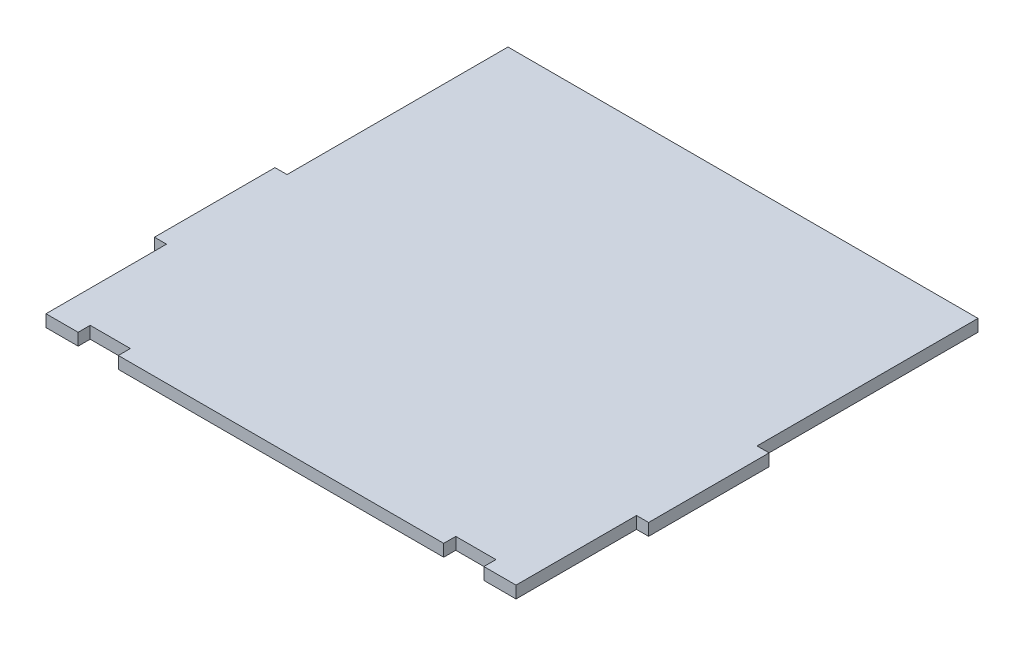
ISO-10303-21;
HEADER;
FILE_DESCRIPTION(('STEP AP214'),'2;1');
FILE_NAME('part.step','',(''),(''),'','','');
FILE_SCHEMA(('AUTOMOTIVE_DESIGN { 1 0 10303 214 1 1 1 1 }'));
ENDSEC;
DATA;
#1=APPLICATION_CONTEXT('core data for automotive mechanical design processes');
#2=APPLICATION_PROTOCOL_DEFINITION('international standard','automotive_design',2000,#1);
#3=PRODUCT_CONTEXT('',#1,'mechanical');
#4=PRODUCT('Part','Part','',(#3));
#5=PRODUCT_RELATED_PRODUCT_CATEGORY('part','',(#4));
#6=PRODUCT_DEFINITION_FORMATION('','',#4);
#7=PRODUCT_DEFINITION_CONTEXT('part definition',#1,'design');
#8=PRODUCT_DEFINITION('design','',#6,#7);
#9=PRODUCT_DEFINITION_SHAPE('','',#8);
#10=(LENGTH_UNIT() NAMED_UNIT(*) SI_UNIT(.MILLI.,.METRE.));
#11=(NAMED_UNIT(*) PLANE_ANGLE_UNIT() SI_UNIT($,.RADIAN.));
#12=(NAMED_UNIT(*) SI_UNIT($,.STERADIAN.) SOLID_ANGLE_UNIT());
#13=UNCERTAINTY_MEASURE_WITH_UNIT(LENGTH_MEASURE(1.E-05),#10,'distance_accuracy_value','');
#14=(GEOMETRIC_REPRESENTATION_CONTEXT(3) GLOBAL_UNCERTAINTY_ASSIGNED_CONTEXT((#13)) GLOBAL_UNIT_ASSIGNED_CONTEXT((#10,
#11,#12)) REPRESENTATION_CONTEXT('',''));
#15=CARTESIAN_POINT('',(0.,0.,0.));
#16=DIRECTION('',(0.,0.,1.));
#17=DIRECTION('',(1.,0.,0.));
#18=AXIS2_PLACEMENT_3D('',#15,#16,#17);
#19=CARTESIAN_POINT('',(-50.5987518046305,3.,26.8319327731092));
#20=DIRECTION('',(0.,0.,-1.));
#21=DIRECTION('',(-1.,0.,0.));
#22=AXIS2_PLACEMENT_3D('',#19,#20,#21);
#23=PLANE('',#22);
#24=DIRECTION('',(1.,0.,0.));
#25=VECTOR('',#24,1.);
#26=CARTESIAN_POINT('',(-50.5987518046305,0.,26.8319327731092));
#27=LINE('',#26,#25);
#28=CARTESIAN_POINT('',(-50.5987518046305,0.,26.8319327731092));
#29=VERTEX_POINT('',#28);
#30=CARTESIAN_POINT('',(-42.5987518046305,0.,26.8319327731092));
#31=VERTEX_POINT('',#30);
#32=EDGE_CURVE('E201',#29,#31,#27,.T.);
#33=ORIENTED_EDGE('',*,*,#32,.T.);
#34=DIRECTION('',(0.,-1.,0.));
#35=VECTOR('',#34,1.);
#36=CARTESIAN_POINT('',(-42.5987518046305,3.,26.8319327731092));
#37=LINE('',#36,#35);
#38=CARTESIAN_POINT('',(-42.5987518046305,3.,26.8319327731092));
#39=VERTEX_POINT('',#38);
#40=EDGE_CURVE('E11',#39,#31,#37,.T.);
#41=ORIENTED_EDGE('',*,*,#40,.F.);
#42=DIRECTION('',(1.,0.,0.));
#43=VECTOR('',#42,1.);
#44=CARTESIAN_POINT('',(-50.5987518046305,3.,26.8319327731092));
#45=LINE('',#44,#43);
#46=CARTESIAN_POINT('',(-50.5987518046305,3.,26.8319327731092));
#47=VERTEX_POINT('',#46);
#48=EDGE_CURVE('E239',#47,#39,#45,.T.);
#49=ORIENTED_EDGE('',*,*,#48,.F.);
#50=DIRECTION('',(0.,-1.,0.));
#51=VECTOR('',#50,1.);
#52=CARTESIAN_POINT('',(-50.5987518046305,3.,26.8319327731092));
#53=LINE('',#52,#51);
#54=EDGE_CURVE('E197',#47,#29,#53,.T.);
#55=ORIENTED_EDGE('',*,*,#54,.T.);
#56=EDGE_LOOP('',(#33,#41,#49,#55));
#57=FACE_BOUND('',#56,.T.);
#58=ADVANCED_FACE('F33',(#57),#23,.F.);
#59=CARTESIAN_POINT('',(-42.5987518046305,3.,26.8319327731092));
#60=DIRECTION('',(-1.,0.,0.));
#61=DIRECTION('',(0.,0.,1.));
#62=AXIS2_PLACEMENT_3D('',#59,#60,#61);
#63=PLANE('',#62);
#64=DIRECTION('',(0.,0.,-1.));
#65=VECTOR('',#64,1.);
#66=CARTESIAN_POINT('',(-42.5987518046305,0.,26.8319327731092));
#67=LINE('',#66,#65);
#68=CARTESIAN_POINT('',(-42.5987518046305,0.,23.8319327731092));
#69=VERTEX_POINT('',#68);
#70=EDGE_CURVE('E204',#31,#69,#67,.T.);
#71=ORIENTED_EDGE('',*,*,#70,.T.);
#72=DIRECTION('',(0.,-1.,0.));
#73=VECTOR('',#72,1.);
#74=CARTESIAN_POINT('',(-42.5987518046305,3.,23.8319327731092));
#75=LINE('',#74,#73);
#76=CARTESIAN_POINT('',(-42.5987518046305,3.,23.8319327731092));
#77=VERTEX_POINT('',#76);
#78=EDGE_CURVE('E41',#77,#69,#75,.T.);
#79=ORIENTED_EDGE('',*,*,#78,.F.);
#80=DIRECTION('',(0.,0.,-1.));
#81=VECTOR('',#80,1.);
#82=CARTESIAN_POINT('',(-42.5987518046305,3.,26.8319327731092));
#83=LINE('',#82,#81);
#84=EDGE_CURVE('E128',#39,#77,#83,.T.);
#85=ORIENTED_EDGE('',*,*,#84,.F.);
#86=ORIENTED_EDGE('',*,*,#40,.T.);
#87=EDGE_LOOP('',(#71,#79,#85,#86));
#88=FACE_BOUND('',#87,.T.);
#89=ADVANCED_FACE('F357',(#88),#63,.F.);
#90=CARTESIAN_POINT('',(-42.5987518046305,3.,23.8319327731092));
#91=DIRECTION('',(0.,0.,-1.));
#92=DIRECTION('',(-1.,0.,0.));
#93=AXIS2_PLACEMENT_3D('',#90,#91,#92);
#94=PLANE('',#93);
#95=DIRECTION('',(1.,0.,0.));
#96=VECTOR('',#95,1.);
#97=CARTESIAN_POINT('',(-42.5987518046305,0.,23.8319327731092));
#98=LINE('',#97,#96);
#99=CARTESIAN_POINT('',(-32.5987518046305,0.,23.8319327731092));
#100=VERTEX_POINT('',#99);
#101=EDGE_CURVE('E206',#69,#100,#98,.T.);
#102=ORIENTED_EDGE('',*,*,#101,.T.);
#103=DIRECTION('',(0.,-1.,0.));
#104=VECTOR('',#103,1.);
#105=CARTESIAN_POINT('',(-32.5987518046305,3.,23.8319327731092));
#106=LINE('',#105,#104);
#107=CARTESIAN_POINT('',(-32.5987518046305,3.,23.8319327731092));
#108=VERTEX_POINT('',#107);
#109=EDGE_CURVE('E282',#108,#100,#106,.T.);
#110=ORIENTED_EDGE('',*,*,#109,.F.);
#111=DIRECTION('',(1.,0.,0.));
#112=VECTOR('',#111,1.);
#113=CARTESIAN_POINT('',(-42.5987518046305,3.,23.8319327731092));
#114=LINE('',#113,#112);
#115=EDGE_CURVE('E290',#77,#108,#114,.T.);
#116=ORIENTED_EDGE('',*,*,#115,.F.);
#117=ORIENTED_EDGE('',*,*,#78,.T.);
#118=EDGE_LOOP('',(#102,#110,#116,#117));
#119=FACE_BOUND('',#118,.T.);
#120=ADVANCED_FACE('F288',(#119),#94,.F.);
#121=CARTESIAN_POINT('',(-32.5987518046305,3.,23.8319327731092));
#122=DIRECTION('',(1.,0.,0.));
#123=DIRECTION('',(0.,0.,-1.));
#124=AXIS2_PLACEMENT_3D('',#121,#122,#123);
#125=PLANE('',#124);
#126=DIRECTION('',(0.,0.,1.));
#127=VECTOR('',#126,1.);
#128=CARTESIAN_POINT('',(-32.5987518046305,0.,23.8319327731092));
#129=LINE('',#128,#127);
#130=CARTESIAN_POINT('',(-32.5987518046305,0.,26.8319327731092));
#131=VERTEX_POINT('',#130);
#132=EDGE_CURVE('E208',#100,#131,#129,.T.);
#133=ORIENTED_EDGE('',*,*,#132,.T.);
#134=DIRECTION('',(0.,-1.,0.));
#135=VECTOR('',#134,1.);
#136=CARTESIAN_POINT('',(-32.5987518046305,3.,26.8319327731092));
#137=LINE('',#136,#135);
#138=CARTESIAN_POINT('',(-32.5987518046305,3.,26.8319327731092));
#139=VERTEX_POINT('',#138);
#140=EDGE_CURVE('E279',#139,#131,#137,.T.);
#141=ORIENTED_EDGE('',*,*,#140,.F.);
#142=DIRECTION('',(0.,0.,1.));
#143=VECTOR('',#142,1.);
#144=CARTESIAN_POINT('',(-32.5987518046305,3.,23.8319327731092));
#145=LINE('',#144,#143);
#146=EDGE_CURVE('E308',#108,#139,#145,.T.);
#147=ORIENTED_EDGE('',*,*,#146,.F.);
#148=ORIENTED_EDGE('',*,*,#109,.T.);
#149=EDGE_LOOP('',(#133,#141,#147,#148));
#150=FACE_BOUND('',#149,.T.);
#151=ADVANCED_FACE('F299',(#150),#125,.F.);
#152=CARTESIAN_POINT('',(-32.5987518046305,3.,26.8319327731092));
#153=DIRECTION('',(0.,0.,-1.));
#154=DIRECTION('',(-1.,0.,0.));
#155=AXIS2_PLACEMENT_3D('',#152,#153,#154);
#156=PLANE('',#155);
#157=DIRECTION('',(1.,0.,0.));
#158=VECTOR('',#157,1.);
#159=CARTESIAN_POINT('',(-32.5987518046305,0.,26.8319327731092));
#160=LINE('',#159,#158);
#161=CARTESIAN_POINT('',(48.4012481953695,0.,26.8319327731092));
#162=VERTEX_POINT('',#161);
#163=EDGE_CURVE('E210',#131,#162,#160,.T.);
#164=ORIENTED_EDGE('',*,*,#163,.T.);
#165=DIRECTION('',(0.,-1.,0.));
#166=VECTOR('',#165,1.);
#167=CARTESIAN_POINT('',(48.4012481953695,3.,26.8319327731092));
#168=LINE('',#167,#166);
#169=CARTESIAN_POINT('',(48.4012481953695,3.,26.8319327731092));
#170=VERTEX_POINT('',#169);
#171=EDGE_CURVE('E276',#170,#162,#168,.T.);
#172=ORIENTED_EDGE('',*,*,#171,.F.);
#173=DIRECTION('',(1.,0.,0.));
#174=VECTOR('',#173,1.);
#175=CARTESIAN_POINT('',(-32.5987518046305,3.,26.8319327731092));
#176=LINE('',#175,#174);
#177=EDGE_CURVE('E305',#139,#170,#176,.T.);
#178=ORIENTED_EDGE('',*,*,#177,.F.);
#179=ORIENTED_EDGE('',*,*,#140,.T.);
#180=EDGE_LOOP('',(#164,#172,#178,#179));
#181=FACE_BOUND('',#180,.T.);
#182=ADVANCED_FACE('F303',(#181),#156,.F.);
#183=CARTESIAN_POINT('',(48.4012481953695,3.,26.8319327731092));
#184=DIRECTION('',(-1.,0.,0.));
#185=DIRECTION('',(0.,0.,1.));
#186=AXIS2_PLACEMENT_3D('',#183,#184,#185);
#187=PLANE('',#186);
#188=DIRECTION('',(0.,0.,-1.));
#189=VECTOR('',#188,1.);
#190=CARTESIAN_POINT('',(48.4012481953695,0.,26.8319327731092));
#191=LINE('',#190,#189);
#192=CARTESIAN_POINT('',(48.4012481953695,0.,23.8319327731092));
#193=VERTEX_POINT('',#192);
#194=EDGE_CURVE('E212',#162,#193,#191,.T.);
#195=ORIENTED_EDGE('',*,*,#194,.T.);
#196=DIRECTION('',(0.,-1.,0.));
#197=VECTOR('',#196,1.);
#198=CARTESIAN_POINT('',(48.4012481953695,3.,23.8319327731092));
#199=LINE('',#198,#197);
#200=CARTESIAN_POINT('',(48.4012481953695,3.,23.8319327731092));
#201=VERTEX_POINT('',#200);
#202=EDGE_CURVE('E273',#201,#193,#199,.T.);
#203=ORIENTED_EDGE('',*,*,#202,.F.);
#204=DIRECTION('',(0.,0.,-1.));
#205=VECTOR('',#204,1.);
#206=CARTESIAN_POINT('',(48.4012481953695,3.,26.8319327731092));
#207=LINE('',#206,#205);
#208=EDGE_CURVE('E307',#170,#201,#207,.T.);
#209=ORIENTED_EDGE('',*,*,#208,.F.);
#210=ORIENTED_EDGE('',*,*,#171,.T.);
#211=EDGE_LOOP('',(#195,#203,#209,#210));
#212=FACE_BOUND('',#211,.T.);
#213=ADVANCED_FACE('F370',(#212),#187,.F.);
#214=CARTESIAN_POINT('',(48.4012481953695,3.,23.8319327731092));
#215=DIRECTION('',(0.,0.,-1.));
#216=DIRECTION('',(-1.,0.,0.));
#217=AXIS2_PLACEMENT_3D('',#214,#215,#216);
#218=PLANE('',#217);
#219=DIRECTION('',(1.,0.,0.));
#220=VECTOR('',#219,1.);
#221=CARTESIAN_POINT('',(48.4012481953695,0.,23.8319327731092));
#222=LINE('',#221,#220);
#223=CARTESIAN_POINT('',(58.4012481953695,0.,23.8319327731092));
#224=VERTEX_POINT('',#223);
#225=EDGE_CURVE('E214',#193,#224,#222,.T.);
#226=ORIENTED_EDGE('',*,*,#225,.T.);
#227=DIRECTION('',(0.,-1.,0.));
#228=VECTOR('',#227,1.);
#229=CARTESIAN_POINT('',(58.4012481953695,3.,23.8319327731092));
#230=LINE('',#229,#228);
#231=CARTESIAN_POINT('',(58.4012481953695,3.,23.8319327731092));
#232=VERTEX_POINT('',#231);
#233=EDGE_CURVE('E270',#232,#224,#230,.T.);
#234=ORIENTED_EDGE('',*,*,#233,.F.);
#235=DIRECTION('',(1.,0.,0.));
#236=VECTOR('',#235,1.);
#237=CARTESIAN_POINT('',(48.4012481953695,3.,23.8319327731092));
#238=LINE('',#237,#236);
#239=EDGE_CURVE('E310',#201,#232,#238,.T.);
#240=ORIENTED_EDGE('',*,*,#239,.F.);
#241=ORIENTED_EDGE('',*,*,#202,.T.);
#242=EDGE_LOOP('',(#226,#234,#240,#241));
#243=FACE_BOUND('',#242,.T.);
#244=ADVANCED_FACE('F373',(#243),#218,.F.);
#245=CARTESIAN_POINT('',(58.4012481953695,3.,23.8319327731092));
#246=DIRECTION('',(1.,0.,0.));
#247=DIRECTION('',(0.,0.,-1.));
#248=AXIS2_PLACEMENT_3D('',#245,#246,#247);
#249=PLANE('',#248);
#250=DIRECTION('',(0.,0.,1.));
#251=VECTOR('',#250,1.);
#252=CARTESIAN_POINT('',(58.4012481953695,0.,23.8319327731092));
#253=LINE('',#252,#251);
#254=CARTESIAN_POINT('',(58.4012481953695,0.,26.8319327731092));
#255=VERTEX_POINT('',#254);
#256=EDGE_CURVE('E216',#224,#255,#253,.T.);
#257=ORIENTED_EDGE('',*,*,#256,.T.);
#258=DIRECTION('',(0.,-1.,0.));
#259=VECTOR('',#258,1.);
#260=CARTESIAN_POINT('',(58.4012481953695,3.,26.8319327731092));
#261=LINE('',#260,#259);
#262=CARTESIAN_POINT('',(58.4012481953695,3.,26.8319327731092));
#263=VERTEX_POINT('',#262);
#264=EDGE_CURVE('E267',#263,#255,#261,.T.);
#265=ORIENTED_EDGE('',*,*,#264,.F.);
#266=DIRECTION('',(0.,0.,1.));
#267=VECTOR('',#266,1.);
#268=CARTESIAN_POINT('',(58.4012481953695,3.,23.8319327731092));
#269=LINE('',#268,#267);
#270=EDGE_CURVE('E316',#232,#263,#269,.T.);
#271=ORIENTED_EDGE('',*,*,#270,.F.);
#272=ORIENTED_EDGE('',*,*,#233,.T.);
#273=EDGE_LOOP('',(#257,#265,#271,#272));
#274=FACE_BOUND('',#273,.T.);
#275=ADVANCED_FACE('F377',(#274),#249,.F.);
#276=CARTESIAN_POINT('',(58.4012481953695,3.,26.8319327731092));
#277=DIRECTION('',(0.,0.,-1.));
#278=DIRECTION('',(-1.,0.,0.));
#279=AXIS2_PLACEMENT_3D('',#276,#277,#278);
#280=PLANE('',#279);
#281=DIRECTION('',(1.,0.,0.));
#282=VECTOR('',#281,1.);
#283=CARTESIAN_POINT('',(58.4012481953695,0.,26.8319327731092));
#284=LINE('',#283,#282);
#285=CARTESIAN_POINT('',(66.4012481953695,0.,26.8319327731092));
#286=VERTEX_POINT('',#285);
#287=EDGE_CURVE('E218',#255,#286,#284,.T.);
#288=ORIENTED_EDGE('',*,*,#287,.T.);
#289=DIRECTION('',(0.,-1.,0.));
#290=VECTOR('',#289,1.);
#291=CARTESIAN_POINT('',(66.4012481953695,3.,26.8319327731092));
#292=LINE('',#291,#290);
#293=CARTESIAN_POINT('',(66.4012481953695,3.,26.8319327731092));
#294=VERTEX_POINT('',#293);
#295=EDGE_CURVE('E264',#294,#286,#292,.T.);
#296=ORIENTED_EDGE('',*,*,#295,.F.);
#297=DIRECTION('',(1.,0.,0.));
#298=VECTOR('',#297,1.);
#299=CARTESIAN_POINT('',(58.4012481953695,3.,26.8319327731092));
#300=LINE('',#299,#298);
#301=EDGE_CURVE('E318',#263,#294,#300,.T.);
#302=ORIENTED_EDGE('',*,*,#301,.F.);
#303=ORIENTED_EDGE('',*,*,#264,.T.);
#304=EDGE_LOOP('',(#288,#296,#302,#303));
#305=FACE_BOUND('',#304,.T.);
#306=ADVANCED_FACE('F381',(#305),#280,.F.);
#307=CARTESIAN_POINT('',(66.4012481953695,3.,-3.16806722689077));
#308=DIRECTION('',(-1.,0.,0.));
#309=DIRECTION('',(0.,0.,1.));
#310=AXIS2_PLACEMENT_3D('',#307,#308,#309);
#311=PLANE('',#310);
#312=DIRECTION('',(0.,0.,-1.));
#313=VECTOR('',#312,1.);
#314=CARTESIAN_POINT('',(66.4012481953695,0.,-3.16806722689077));
#315=LINE('',#314,#313);
#316=CARTESIAN_POINT('',(66.4012481953695,0.,-3.16806722689077));
#317=VERTEX_POINT('',#316);
#318=EDGE_CURVE('E220',#286,#317,#315,.T.);
#319=ORIENTED_EDGE('',*,*,#318,.T.);
#320=DIRECTION('',(0.,-1.,0.));
#321=VECTOR('',#320,1.);
#322=CARTESIAN_POINT('',(66.4012481953695,3.,-3.16806722689077));
#323=LINE('',#322,#321);
#324=CARTESIAN_POINT('',(66.4012481953695,3.,-3.16806722689077));
#325=VERTEX_POINT('',#324);
#326=EDGE_CURVE('E261',#325,#317,#323,.T.);
#327=ORIENTED_EDGE('',*,*,#326,.F.);
#328=DIRECTION('',(0.,0.,-1.));
#329=VECTOR('',#328,1.);
#330=CARTESIAN_POINT('',(66.4012481953695,3.,-3.16806722689077));
#331=LINE('',#330,#329);
#332=EDGE_CURVE('E320',#294,#325,#331,.T.);
#333=ORIENTED_EDGE('',*,*,#332,.F.);
#334=ORIENTED_EDGE('',*,*,#295,.T.);
#335=EDGE_LOOP('',(#319,#327,#333,#334));
#336=FACE_BOUND('',#335,.T.);
#337=ADVANCED_FACE('F385',(#336),#311,.F.);
#338=CARTESIAN_POINT('',(69.4012481953695,3.,-3.16806722689077));
#339=DIRECTION('',(0.,0.,-1.));
#340=DIRECTION('',(-1.,0.,0.));
#341=AXIS2_PLACEMENT_3D('',#338,#339,#340);
#342=PLANE('',#341);
#343=DIRECTION('',(1.,0.,0.));
#344=VECTOR('',#343,1.);
#345=CARTESIAN_POINT('',(69.4012481953695,0.,-3.16806722689077));
#346=LINE('',#345,#344);
#347=CARTESIAN_POINT('',(69.4012481953695,0.,-3.16806722689077));
#348=VERTEX_POINT('',#347);
#349=EDGE_CURVE('E222',#317,#348,#346,.T.);
#350=ORIENTED_EDGE('',*,*,#349,.T.);
#351=DIRECTION('',(0.,-1.,0.));
#352=VECTOR('',#351,1.);
#353=CARTESIAN_POINT('',(69.4012481953695,3.,-3.16806722689077));
#354=LINE('',#353,#352);
#355=CARTESIAN_POINT('',(69.4012481953695,3.,-3.16806722689077));
#356=VERTEX_POINT('',#355);
#357=EDGE_CURVE('E258',#356,#348,#354,.T.);
#358=ORIENTED_EDGE('',*,*,#357,.F.);
#359=DIRECTION('',(1.,0.,0.));
#360=VECTOR('',#359,1.);
#361=CARTESIAN_POINT('',(69.4012481953695,3.,-3.16806722689077));
#362=LINE('',#361,#360);
#363=EDGE_CURVE('E322',#325,#356,#362,.T.);
#364=ORIENTED_EDGE('',*,*,#363,.F.);
#365=ORIENTED_EDGE('',*,*,#326,.T.);
#366=EDGE_LOOP('',(#350,#358,#364,#365));
#367=FACE_BOUND('',#366,.T.);
#368=ADVANCED_FACE('F389',(#367),#342,.F.);
#369=CARTESIAN_POINT('',(69.4012481953695,3.,-33.1680672268907));
#370=DIRECTION('',(-1.,0.,0.));
#371=DIRECTION('',(0.,0.,1.));
#372=AXIS2_PLACEMENT_3D('',#369,#370,#371);
#373=PLANE('',#372);
#374=DIRECTION('',(0.,0.,-1.));
#375=VECTOR('',#374,1.);
#376=CARTESIAN_POINT('',(69.4012481953695,0.,-33.1680672268907));
#377=LINE('',#376,#375);
#378=CARTESIAN_POINT('',(69.4012481953695,0.,-33.1680672268907));
#379=VERTEX_POINT('',#378);
#380=EDGE_CURVE('E224',#348,#379,#377,.T.);
#381=ORIENTED_EDGE('',*,*,#380,.T.);
#382=DIRECTION('',(0.,-1.,0.));
#383=VECTOR('',#382,1.);
#384=CARTESIAN_POINT('',(69.4012481953695,3.,-33.1680672268907));
#385=LINE('',#384,#383);
#386=CARTESIAN_POINT('',(69.4012481953695,3.,-33.1680672268907));
#387=VERTEX_POINT('',#386);
#388=EDGE_CURVE('E255',#387,#379,#385,.T.);
#389=ORIENTED_EDGE('',*,*,#388,.F.);
#390=DIRECTION('',(0.,0.,-1.));
#391=VECTOR('',#390,1.);
#392=CARTESIAN_POINT('',(69.4012481953695,3.,-33.1680672268907));
#393=LINE('',#392,#391);
#394=EDGE_CURVE('E324',#356,#387,#393,.T.);
#395=ORIENTED_EDGE('',*,*,#394,.F.);
#396=ORIENTED_EDGE('',*,*,#357,.T.);
#397=EDGE_LOOP('',(#381,#389,#395,#396));
#398=FACE_BOUND('',#397,.T.);
#399=ADVANCED_FACE('F393',(#398),#373,.F.);
#400=CARTESIAN_POINT('',(66.4012481953695,3.,-33.1680672268907));
#401=DIRECTION('',(0.,0.,1.));
#402=DIRECTION('',(1.,0.,0.));
#403=AXIS2_PLACEMENT_3D('',#400,#401,#402);
#404=PLANE('',#403);
#405=DIRECTION('',(-1.,0.,0.));
#406=VECTOR('',#405,1.);
#407=CARTESIAN_POINT('',(66.4012481953695,0.,-33.1680672268907));
#408=LINE('',#407,#406);
#409=CARTESIAN_POINT('',(66.4012481953695,0.,-33.1680672268907));
#410=VERTEX_POINT('',#409);
#411=EDGE_CURVE('E226',#379,#410,#408,.T.);
#412=ORIENTED_EDGE('',*,*,#411,.T.);
#413=DIRECTION('',(0.,-1.,0.));
#414=VECTOR('',#413,1.);
#415=CARTESIAN_POINT('',(66.4012481953695,3.,-33.1680672268907));
#416=LINE('',#415,#414);
#417=CARTESIAN_POINT('',(66.4012481953695,3.,-33.1680672268907));
#418=VERTEX_POINT('',#417);
#419=EDGE_CURVE('E252',#418,#410,#416,.T.);
#420=ORIENTED_EDGE('',*,*,#419,.F.);
#421=DIRECTION('',(-1.,0.,0.));
#422=VECTOR('',#421,1.);
#423=CARTESIAN_POINT('',(66.4012481953695,3.,-33.1680672268907));
#424=LINE('',#423,#422);
#425=EDGE_CURVE('E326',#387,#418,#424,.T.);
#426=ORIENTED_EDGE('',*,*,#425,.F.);
#427=ORIENTED_EDGE('',*,*,#388,.T.);
#428=EDGE_LOOP('',(#412,#420,#426,#427));
#429=FACE_BOUND('',#428,.T.);
#430=ADVANCED_FACE('F397',(#429),#404,.F.);
#431=CARTESIAN_POINT('',(66.4012481953695,3.,-88.1680672268908));
#432=DIRECTION('',(-1.,0.,0.));
#433=DIRECTION('',(0.,0.,1.));
#434=AXIS2_PLACEMENT_3D('',#431,#432,#433);
#435=PLANE('',#434);
#436=DIRECTION('',(0.,0.,-1.));
#437=VECTOR('',#436,1.);
#438=CARTESIAN_POINT('',(66.4012481953695,0.,-88.1680672268908));
#439=LINE('',#438,#437);
#440=CARTESIAN_POINT('',(66.4012481953695,0.,-88.1680672268908));
#441=VERTEX_POINT('',#440);
#442=EDGE_CURVE('E228',#410,#441,#439,.T.);
#443=ORIENTED_EDGE('',*,*,#442,.T.);
#444=DIRECTION('',(0.,-1.,0.));
#445=VECTOR('',#444,1.);
#446=CARTESIAN_POINT('',(66.4012481953695,3.,-88.1680672268908));
#447=LINE('',#446,#445);
#448=CARTESIAN_POINT('',(66.4012481953695,3.,-88.1680672268908));
#449=VERTEX_POINT('',#448);
#450=EDGE_CURVE('E249',#449,#441,#447,.T.);
#451=ORIENTED_EDGE('',*,*,#450,.F.);
#452=DIRECTION('',(0.,0.,-1.));
#453=VECTOR('',#452,1.);
#454=CARTESIAN_POINT('',(66.4012481953695,3.,-88.1680672268908));
#455=LINE('',#454,#453);
#456=EDGE_CURVE('E328',#418,#449,#455,.T.);
#457=ORIENTED_EDGE('',*,*,#456,.F.);
#458=ORIENTED_EDGE('',*,*,#419,.T.);
#459=EDGE_LOOP('',(#443,#451,#457,#458));
#460=FACE_BOUND('',#459,.T.);
#461=ADVANCED_FACE('F401',(#460),#435,.F.);
#462=CARTESIAN_POINT('',(-50.5987518046305,3.,-88.1680672268908));
#463=DIRECTION('',(0.,0.,1.));
#464=DIRECTION('',(1.,0.,0.));
#465=AXIS2_PLACEMENT_3D('',#462,#463,#464);
#466=PLANE('',#465);
#467=DIRECTION('',(-1.,0.,0.));
#468=VECTOR('',#467,1.);
#469=CARTESIAN_POINT('',(-50.5987518046305,0.,-88.1680672268908));
#470=LINE('',#469,#468);
#471=CARTESIAN_POINT('',(-50.5987518046305,0.,-88.1680672268908));
#472=VERTEX_POINT('',#471);
#473=EDGE_CURVE('E230',#441,#472,#470,.T.);
#474=ORIENTED_EDGE('',*,*,#473,.T.);
#475=DIRECTION('',(0.,-1.,0.));
#476=VECTOR('',#475,1.);
#477=CARTESIAN_POINT('',(-50.5987518046305,3.,-88.1680672268908));
#478=LINE('',#477,#476);
#479=CARTESIAN_POINT('',(-50.5987518046305,3.,-88.1680672268908));
#480=VERTEX_POINT('',#479);
#481=EDGE_CURVE('E246',#480,#472,#478,.T.);
#482=ORIENTED_EDGE('',*,*,#481,.F.);
#483=DIRECTION('',(-1.,0.,0.));
#484=VECTOR('',#483,1.);
#485=CARTESIAN_POINT('',(-50.5987518046305,3.,-88.1680672268908));
#486=LINE('',#485,#484);
#487=EDGE_CURVE('E330',#449,#480,#486,.T.);
#488=ORIENTED_EDGE('',*,*,#487,.F.);
#489=ORIENTED_EDGE('',*,*,#450,.T.);
#490=EDGE_LOOP('',(#474,#482,#488,#489));
#491=FACE_BOUND('',#490,.T.);
#492=ADVANCED_FACE('F405',(#491),#466,.F.);
#493=CARTESIAN_POINT('',(-50.5987518046305,3.,-33.1680672268908));
#494=DIRECTION('',(1.,0.,0.));
#495=DIRECTION('',(0.,0.,-1.));
#496=AXIS2_PLACEMENT_3D('',#493,#494,#495);
#497=PLANE('',#496);
#498=DIRECTION('',(0.,0.,1.));
#499=VECTOR('',#498,1.);
#500=CARTESIAN_POINT('',(-50.5987518046305,0.,-33.1680672268908));
#501=LINE('',#500,#499);
#502=CARTESIAN_POINT('',(-50.5987518046305,0.,-33.1680672268908));
#503=VERTEX_POINT('',#502);
#504=EDGE_CURVE('E232',#472,#503,#501,.T.);
#505=ORIENTED_EDGE('',*,*,#504,.T.);
#506=DIRECTION('',(0.,-1.,0.));
#507=VECTOR('',#506,1.);
#508=CARTESIAN_POINT('',(-50.5987518046305,3.,-33.1680672268908));
#509=LINE('',#508,#507);
#510=CARTESIAN_POINT('',(-50.5987518046305,3.,-33.1680672268908));
#511=VERTEX_POINT('',#510);
#512=EDGE_CURVE('E243',#511,#503,#509,.T.);
#513=ORIENTED_EDGE('',*,*,#512,.F.);
#514=DIRECTION('',(0.,0.,1.));
#515=VECTOR('',#514,1.);
#516=CARTESIAN_POINT('',(-50.5987518046305,3.,-33.1680672268908));
#517=LINE('',#516,#515);
#518=EDGE_CURVE('E332',#480,#511,#517,.T.);
#519=ORIENTED_EDGE('',*,*,#518,.F.);
#520=ORIENTED_EDGE('',*,*,#481,.T.);
#521=EDGE_LOOP('',(#505,#513,#519,#520));
#522=FACE_BOUND('',#521,.T.);
#523=ADVANCED_FACE('F338',(#522),#497,.F.);
#524=CARTESIAN_POINT('',(-53.5987518046305,3.,-33.1680672268907));
#525=DIRECTION('',(0.,0.,1.));
#526=DIRECTION('',(1.,0.,0.));
#527=AXIS2_PLACEMENT_3D('',#524,#525,#526);
#528=PLANE('',#527);
#529=DIRECTION('',(-1.,0.,0.));
#530=VECTOR('',#529,1.);
#531=CARTESIAN_POINT('',(-53.5987518046305,0.,-33.1680672268907));
#532=LINE('',#531,#530);
#533=CARTESIAN_POINT('',(-53.5987518046305,0.,-33.1680672268907));
#534=VERTEX_POINT('',#533);
#535=EDGE_CURVE('E234',#503,#534,#532,.T.);
#536=ORIENTED_EDGE('',*,*,#535,.T.);
#537=DIRECTION('',(0.,-1.,0.));
#538=VECTOR('',#537,1.);
#539=CARTESIAN_POINT('',(-53.5987518046305,3.,-33.1680672268907));
#540=LINE('',#539,#538);
#541=CARTESIAN_POINT('',(-53.5987518046305,3.,-33.1680672268907));
#542=VERTEX_POINT('',#541);
#543=EDGE_CURVE('E192',#542,#534,#540,.T.);
#544=ORIENTED_EDGE('',*,*,#543,.F.);
#545=DIRECTION('',(-1.,0.,0.));
#546=VECTOR('',#545,1.);
#547=CARTESIAN_POINT('',(-53.5987518046305,3.,-33.1680672268907));
#548=LINE('',#547,#546);
#549=EDGE_CURVE('E183',#511,#542,#548,.T.);
#550=ORIENTED_EDGE('',*,*,#549,.F.);
#551=ORIENTED_EDGE('',*,*,#512,.T.);
#552=EDGE_LOOP('',(#536,#544,#550,#551));
#553=FACE_BOUND('',#552,.T.);
#554=ADVANCED_FACE('F342',(#553),#528,.F.);
#555=CARTESIAN_POINT('',(-53.5987518046305,3.,-3.16806722689075));
#556=DIRECTION('',(1.,0.,0.));
#557=DIRECTION('',(0.,0.,-1.));
#558=AXIS2_PLACEMENT_3D('',#555,#556,#557);
#559=PLANE('',#558);
#560=DIRECTION('',(0.,0.,1.));
#561=VECTOR('',#560,1.);
#562=CARTESIAN_POINT('',(-53.5987518046305,0.,-3.16806722689075));
#563=LINE('',#562,#561);
#564=CARTESIAN_POINT('',(-53.5987518046305,0.,-3.16806722689075));
#565=VERTEX_POINT('',#564);
#566=EDGE_CURVE('E191',#534,#565,#563,.T.);
#567=ORIENTED_EDGE('',*,*,#566,.T.);
#568=DIRECTION('',(0.,-1.,0.));
#569=VECTOR('',#568,1.);
#570=CARTESIAN_POINT('',(-53.5987518046305,3.,-3.16806722689075));
#571=LINE('',#570,#569);
#572=CARTESIAN_POINT('',(-53.5987518046305,3.,-3.16806722689075));
#573=VERTEX_POINT('',#572);
#574=EDGE_CURVE('E188',#573,#565,#571,.T.);
#575=ORIENTED_EDGE('',*,*,#574,.F.);
#576=DIRECTION('',(0.,0.,1.));
#577=VECTOR('',#576,1.);
#578=CARTESIAN_POINT('',(-53.5987518046305,3.,-3.16806722689075));
#579=LINE('',#578,#577);
#580=EDGE_CURVE('E177',#542,#573,#579,.T.);
#581=ORIENTED_EDGE('',*,*,#580,.F.);
#582=ORIENTED_EDGE('',*,*,#543,.T.);
#583=EDGE_LOOP('',(#567,#575,#581,#582));
#584=FACE_BOUND('',#583,.T.);
#585=ADVANCED_FACE('F189',(#584),#559,.F.);
#586=CARTESIAN_POINT('',(-50.5987518046305,3.,-3.16806722689075));
#587=DIRECTION('',(0.,0.,-1.));
#588=DIRECTION('',(-1.,0.,0.));
#589=AXIS2_PLACEMENT_3D('',#586,#587,#588);
#590=PLANE('',#589);
#591=DIRECTION('',(1.,0.,0.));
#592=VECTOR('',#591,1.);
#593=CARTESIAN_POINT('',(-50.5987518046305,0.,-3.16806722689075));
#594=LINE('',#593,#592);
#595=CARTESIAN_POINT('',(-50.5987518046305,0.,-3.16806722689075));
#596=VERTEX_POINT('',#595);
#597=EDGE_CURVE('E114',#565,#596,#594,.T.);
#598=ORIENTED_EDGE('',*,*,#597,.T.);
#599=DIRECTION('',(0.,-1.,0.));
#600=VECTOR('',#599,1.);
#601=CARTESIAN_POINT('',(-50.5987518046305,3.,-3.16806722689075));
#602=LINE('',#601,#600);
#603=CARTESIAN_POINT('',(-50.5987518046305,3.,-3.16806722689075));
#604=VERTEX_POINT('',#603);
#605=EDGE_CURVE('E193',#604,#596,#602,.T.);
#606=ORIENTED_EDGE('',*,*,#605,.F.);
#607=DIRECTION('',(1.,0.,0.));
#608=VECTOR('',#607,1.);
#609=CARTESIAN_POINT('',(-50.5987518046305,3.,-3.16806722689075));
#610=LINE('',#609,#608);
#611=EDGE_CURVE('E181',#573,#604,#610,.T.);
#612=ORIENTED_EDGE('',*,*,#611,.F.);
#613=ORIENTED_EDGE('',*,*,#574,.T.);
#614=EDGE_LOOP('',(#598,#606,#612,#613));
#615=FACE_BOUND('',#614,.T.);
#616=ADVANCED_FACE('F195',(#615),#590,.F.);
#617=CARTESIAN_POINT('',(-50.5987518046305,3.,26.8319327731092));
#618=DIRECTION('',(1.,0.,0.));
#619=DIRECTION('',(0.,0.,-1.));
#620=AXIS2_PLACEMENT_3D('',#617,#618,#619);
#621=PLANE('',#620);
#622=DIRECTION('',(0.,0.,1.));
#623=VECTOR('',#622,1.);
#624=CARTESIAN_POINT('',(-50.5987518046305,0.,26.8319327731092));
#625=LINE('',#624,#623);
#626=EDGE_CURVE('E120',#596,#29,#625,.T.);
#627=ORIENTED_EDGE('',*,*,#626,.T.);
#628=ORIENTED_EDGE('',*,*,#54,.F.);
#629=DIRECTION('',(0.,0.,1.));
#630=VECTOR('',#629,1.);
#631=CARTESIAN_POINT('',(-50.5987518046305,3.,26.8319327731092));
#632=LINE('',#631,#630);
#633=EDGE_CURVE('E49',#604,#47,#632,.T.);
#634=ORIENTED_EDGE('',*,*,#633,.F.);
#635=ORIENTED_EDGE('',*,*,#605,.T.);
#636=EDGE_LOOP('',(#627,#628,#634,#635));
#637=FACE_BOUND('',#636,.T.);
#638=ADVANCED_FACE('F346',(#637),#621,.F.);
#639=CARTESIAN_POINT('',(0.,3.,0.));
#640=DIRECTION('',(0.,1.,0.));
#641=DIRECTION('',(0.,0.,1.));
#642=AXIS2_PLACEMENT_3D('',#639,#640,#641);
#643=PLANE('',#642);
#644=ORIENTED_EDGE('',*,*,#48,.T.);
#645=ORIENTED_EDGE('',*,*,#84,.T.);
#646=ORIENTED_EDGE('',*,*,#115,.T.);
#647=ORIENTED_EDGE('',*,*,#146,.T.);
#648=ORIENTED_EDGE('',*,*,#177,.T.);
#649=ORIENTED_EDGE('',*,*,#208,.T.);
#650=ORIENTED_EDGE('',*,*,#239,.T.);
#651=ORIENTED_EDGE('',*,*,#270,.T.);
#652=ORIENTED_EDGE('',*,*,#301,.T.);
#653=ORIENTED_EDGE('',*,*,#332,.T.);
#654=ORIENTED_EDGE('',*,*,#363,.T.);
#655=ORIENTED_EDGE('',*,*,#394,.T.);
#656=ORIENTED_EDGE('',*,*,#425,.T.);
#657=ORIENTED_EDGE('',*,*,#456,.T.);
#658=ORIENTED_EDGE('',*,*,#487,.T.);
#659=ORIENTED_EDGE('',*,*,#518,.T.);
#660=ORIENTED_EDGE('',*,*,#549,.T.);
#661=ORIENTED_EDGE('',*,*,#580,.T.);
#662=ORIENTED_EDGE('',*,*,#611,.T.);
#663=ORIENTED_EDGE('',*,*,#633,.T.);
#664=EDGE_LOOP('',(#644,#645,#646,#647,#648,#649,#650,#651,#652,#653,#654,#655,#656,#657,#658,
#659,#660,#661,#662,#663));
#665=FACE_BOUND('',#664,.T.);
#666=ADVANCED_FACE('F179',(#665),#643,.T.);
#667=CARTESIAN_POINT('',(0.,0.,0.));
#668=DIRECTION('',(0.,1.,0.));
#669=DIRECTION('',(0.,0.,1.));
#670=AXIS2_PLACEMENT_3D('',#667,#668,#669);
#671=PLANE('',#670);
#672=ORIENTED_EDGE('',*,*,#32,.F.);
#673=ORIENTED_EDGE('',*,*,#626,.F.);
#674=ORIENTED_EDGE('',*,*,#597,.F.);
#675=ORIENTED_EDGE('',*,*,#566,.F.);
#676=ORIENTED_EDGE('',*,*,#535,.F.);
#677=ORIENTED_EDGE('',*,*,#504,.F.);
#678=ORIENTED_EDGE('',*,*,#473,.F.);
#679=ORIENTED_EDGE('',*,*,#442,.F.);
#680=ORIENTED_EDGE('',*,*,#411,.F.);
#681=ORIENTED_EDGE('',*,*,#380,.F.);
#682=ORIENTED_EDGE('',*,*,#349,.F.);
#683=ORIENTED_EDGE('',*,*,#318,.F.);
#684=ORIENTED_EDGE('',*,*,#287,.F.);
#685=ORIENTED_EDGE('',*,*,#256,.F.);
#686=ORIENTED_EDGE('',*,*,#225,.F.);
#687=ORIENTED_EDGE('',*,*,#194,.F.);
#688=ORIENTED_EDGE('',*,*,#163,.F.);
#689=ORIENTED_EDGE('',*,*,#132,.F.);
#690=ORIENTED_EDGE('',*,*,#101,.F.);
#691=ORIENTED_EDGE('',*,*,#70,.F.);
#692=EDGE_LOOP('',(#672,#673,#674,#675,#676,#677,#678,#679,#680,#681,#682,#683,#684,#685,#686,
#687,#688,#689,#690,#691));
#693=FACE_BOUND('',#692,.T.);
#694=ADVANCED_FACE('F294',(#693),#671,.F.);
#695=CLOSED_SHELL('',(#58,#89,#120,#151,#182,#213,#244,#275,#306,#337,#368,#399,#430,#461,#492,
#523,#554,#585,#616,#638,#666,#694));
#696=MANIFOLD_SOLID_BREP('B2',#695);
#697=ADVANCED_BREP_SHAPE_REPRESENTATION('',(#18,#696),#14);
#698=SHAPE_DEFINITION_REPRESENTATION(#9,#697);
ENDSEC;
END-ISO-10303-21;
